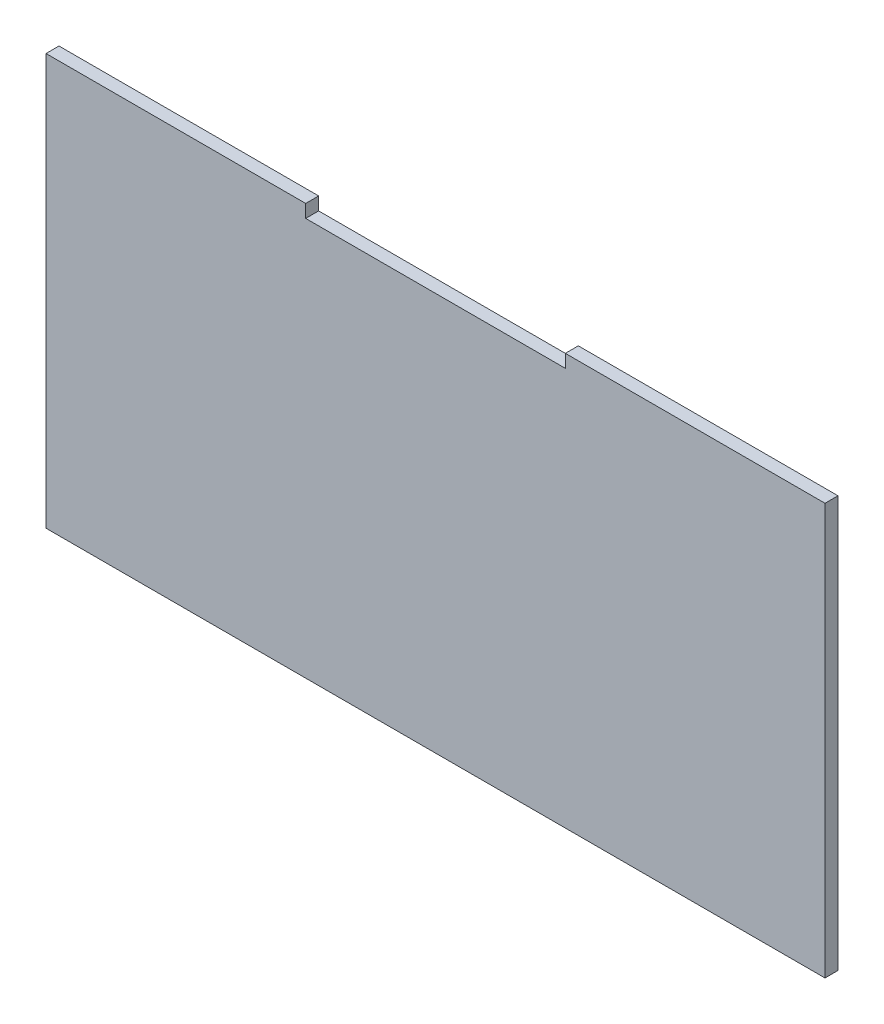
ISO-10303-21;
HEADER;
FILE_DESCRIPTION(('STEP AP214'),'2;1');
FILE_NAME('part.step','',(''),(''),'','','');
FILE_SCHEMA(('AUTOMOTIVE_DESIGN { 1 0 10303 214 1 1 1 1 }'));
ENDSEC;
DATA;
#1=APPLICATION_CONTEXT('core data for automotive mechanical design processes');
#2=APPLICATION_PROTOCOL_DEFINITION('international standard','automotive_design',2000,#1);
#3=PRODUCT_CONTEXT('',#1,'mechanical');
#4=PRODUCT('Part','Part','',(#3));
#5=PRODUCT_RELATED_PRODUCT_CATEGORY('part','',(#4));
#6=PRODUCT_DEFINITION_FORMATION('','',#4);
#7=PRODUCT_DEFINITION_CONTEXT('part definition',#1,'design');
#8=PRODUCT_DEFINITION('design','',#6,#7);
#9=PRODUCT_DEFINITION_SHAPE('','',#8);
#10=(LENGTH_UNIT() NAMED_UNIT(*) SI_UNIT(.MILLI.,.METRE.));
#11=(NAMED_UNIT(*) PLANE_ANGLE_UNIT() SI_UNIT($,.RADIAN.));
#12=(NAMED_UNIT(*) SI_UNIT($,.STERADIAN.) SOLID_ANGLE_UNIT());
#13=UNCERTAINTY_MEASURE_WITH_UNIT(LENGTH_MEASURE(1.E-05),#10,'distance_accuracy_value','');
#14=(GEOMETRIC_REPRESENTATION_CONTEXT(3) GLOBAL_UNCERTAINTY_ASSIGNED_CONTEXT((#13)) GLOBAL_UNIT_ASSIGNED_CONTEXT((#10,
#11,#12)) REPRESENTATION_CONTEXT('',''));
#15=CARTESIAN_POINT('',(0.,0.,0.));
#16=DIRECTION('',(0.,0.,1.));
#17=DIRECTION('',(1.,0.,0.));
#18=AXIS2_PLACEMENT_3D('',#15,#16,#17);
#19=CARTESIAN_POINT('',(-90.,47.5,3.));
#20=DIRECTION('',(1.,0.,0.));
#21=DIRECTION('',(0.,0.,-1.));
#22=AXIS2_PLACEMENT_3D('',#19,#20,#21);
#23=PLANE('',#22);
#24=DIRECTION('',(0.,-1.,0.));
#25=VECTOR('',#24,1.);
#26=CARTESIAN_POINT('',(-90.,47.5,0.));
#27=LINE('',#26,#25);
#28=CARTESIAN_POINT('',(-90.,47.5,0.));
#29=VERTEX_POINT('',#28);
#30=CARTESIAN_POINT('',(-90.,-47.5,0.));
#31=VERTEX_POINT('',#30);
#32=EDGE_CURVE('E130',#29,#31,#27,.T.);
#33=ORIENTED_EDGE('',*,*,#32,.T.);
#34=DIRECTION('',(0.,0.,-1.));
#35=VECTOR('',#34,1.);
#36=CARTESIAN_POINT('',(-90.,-47.5,3.));
#37=LINE('',#36,#35);
#38=CARTESIAN_POINT('',(-90.,-47.5,3.));
#39=VERTEX_POINT('',#38);
#40=EDGE_CURVE('E11',#39,#31,#37,.T.);
#41=ORIENTED_EDGE('',*,*,#40,.F.);
#42=DIRECTION('',(0.,-1.,0.));
#43=VECTOR('',#42,1.);
#44=CARTESIAN_POINT('',(-90.,47.5,3.));
#45=LINE('',#44,#43);
#46=CARTESIAN_POINT('',(-90.,47.5,3.));
#47=VERTEX_POINT('',#46);
#48=EDGE_CURVE('E144',#47,#39,#45,.T.);
#49=ORIENTED_EDGE('',*,*,#48,.F.);
#50=DIRECTION('',(0.,0.,-1.));
#51=VECTOR('',#50,1.);
#52=CARTESIAN_POINT('',(-90.,47.5,3.));
#53=LINE('',#52,#51);
#54=EDGE_CURVE('E126',#47,#29,#53,.T.);
#55=ORIENTED_EDGE('',*,*,#54,.T.);
#56=EDGE_LOOP('',(#33,#41,#49,#55));
#57=FACE_BOUND('',#56,.T.);
#58=ADVANCED_FACE('F34',(#57),#23,.F.);
#59=CARTESIAN_POINT('',(90.,-47.5,3.));
#60=DIRECTION('',(0.,1.,0.));
#61=DIRECTION('',(0.,0.,1.));
#62=AXIS2_PLACEMENT_3D('',#59,#60,#61);
#63=PLANE('',#62);
#64=DIRECTION('',(1.,0.,0.));
#65=VECTOR('',#64,1.);
#66=CARTESIAN_POINT('',(90.,-47.5,0.));
#67=LINE('',#66,#65);
#68=CARTESIAN_POINT('',(90.,-47.5,0.));
#69=VERTEX_POINT('',#68);
#70=EDGE_CURVE('E133',#31,#69,#67,.T.);
#71=ORIENTED_EDGE('',*,*,#70,.T.);
#72=DIRECTION('',(0.,0.,-1.));
#73=VECTOR('',#72,1.);
#74=CARTESIAN_POINT('',(90.,-47.5,3.));
#75=LINE('',#74,#73);
#76=CARTESIAN_POINT('',(90.,-47.5,3.));
#77=VERTEX_POINT('',#76);
#78=EDGE_CURVE('E42',#77,#69,#75,.T.);
#79=ORIENTED_EDGE('',*,*,#78,.F.);
#80=DIRECTION('',(1.,0.,0.));
#81=VECTOR('',#80,1.);
#82=CARTESIAN_POINT('',(90.,-47.5,3.));
#83=LINE('',#82,#81);
#84=EDGE_CURVE('E93',#39,#77,#83,.T.);
#85=ORIENTED_EDGE('',*,*,#84,.F.);
#86=ORIENTED_EDGE('',*,*,#40,.T.);
#87=EDGE_LOOP('',(#71,#79,#85,#86));
#88=FACE_BOUND('',#87,.T.);
#89=ADVANCED_FACE('F179',(#88),#63,.F.);
#90=CARTESIAN_POINT('',(90.,47.5,3.));
#91=DIRECTION('',(-1.,0.,0.));
#92=DIRECTION('',(0.,0.,1.));
#93=AXIS2_PLACEMENT_3D('',#90,#91,#92);
#94=PLANE('',#93);
#95=DIRECTION('',(0.,1.,0.));
#96=VECTOR('',#95,1.);
#97=CARTESIAN_POINT('',(90.,47.5,0.));
#98=LINE('',#97,#96);
#99=CARTESIAN_POINT('',(90.,47.5,0.));
#100=VERTEX_POINT('',#99);
#101=EDGE_CURVE('E135',#69,#100,#98,.T.);
#102=ORIENTED_EDGE('',*,*,#101,.T.);
#103=DIRECTION('',(0.,0.,-1.));
#104=VECTOR('',#103,1.);
#105=CARTESIAN_POINT('',(90.,47.5,3.));
#106=LINE('',#105,#104);
#107=CARTESIAN_POINT('',(90.,47.5,3.));
#108=VERTEX_POINT('',#107);
#109=EDGE_CURVE('E151',#108,#100,#106,.T.);
#110=ORIENTED_EDGE('',*,*,#109,.F.);
#111=DIRECTION('',(0.,1.,0.));
#112=VECTOR('',#111,1.);
#113=CARTESIAN_POINT('',(90.,47.5,3.));
#114=LINE('',#113,#112);
#115=EDGE_CURVE('E159',#77,#108,#114,.T.);
#116=ORIENTED_EDGE('',*,*,#115,.F.);
#117=ORIENTED_EDGE('',*,*,#78,.T.);
#118=EDGE_LOOP('',(#102,#110,#116,#117));
#119=FACE_BOUND('',#118,.T.);
#120=ADVANCED_FACE('F157',(#119),#94,.F.);
#121=CARTESIAN_POINT('',(90.,47.5,3.));
#122=DIRECTION('',(0.,-1.,0.));
#123=DIRECTION('',(0.,0.,-1.));
#124=AXIS2_PLACEMENT_3D('',#121,#122,#123);
#125=PLANE('',#124);
#126=DIRECTION('',(-1.,0.,0.));
#127=VECTOR('',#126,1.);
#128=CARTESIAN_POINT('',(90.,47.5,0.));
#129=LINE('',#128,#127);
#130=CARTESIAN_POINT('',(30.,47.5,0.));
#131=VERTEX_POINT('',#130);
#132=EDGE_CURVE('E137',#100,#131,#129,.T.);
#133=ORIENTED_EDGE('',*,*,#132,.T.);
#134=DIRECTION('',(0.,0.,-1.));
#135=VECTOR('',#134,1.);
#136=CARTESIAN_POINT('',(30.,47.5,3.));
#137=LINE('',#136,#135);
#138=CARTESIAN_POINT('',(30.,47.5,3.));
#139=VERTEX_POINT('',#138);
#140=EDGE_CURVE('E148',#139,#131,#137,.T.);
#141=ORIENTED_EDGE('',*,*,#140,.F.);
#142=DIRECTION('',(-1.,0.,0.));
#143=VECTOR('',#142,1.);
#144=CARTESIAN_POINT('',(90.,47.5,3.));
#145=LINE('',#144,#143);
#146=EDGE_CURVE('E171',#108,#139,#145,.T.);
#147=ORIENTED_EDGE('',*,*,#146,.F.);
#148=ORIENTED_EDGE('',*,*,#109,.T.);
#149=EDGE_LOOP('',(#133,#141,#147,#148));
#150=FACE_BOUND('',#149,.T.);
#151=ADVANCED_FACE('F167',(#150),#125,.F.);
#152=CARTESIAN_POINT('',(30.,47.5,3.));
#153=DIRECTION('',(1.,0.,0.));
#154=DIRECTION('',(0.,0.,-1.));
#155=AXIS2_PLACEMENT_3D('',#152,#153,#154);
#156=PLANE('',#155);
#157=DIRECTION('',(0.,-1.,0.));
#158=VECTOR('',#157,1.);
#159=CARTESIAN_POINT('',(30.,47.5,0.));
#160=LINE('',#159,#158);
#161=CARTESIAN_POINT('',(30.,44.4999999999999,0.));
#162=VERTEX_POINT('',#161);
#163=EDGE_CURVE('E139',#131,#162,#160,.T.);
#164=ORIENTED_EDGE('',*,*,#163,.T.);
#165=DIRECTION('',(0.,0.,-1.));
#166=VECTOR('',#165,1.);
#167=CARTESIAN_POINT('',(30.,44.4999999999999,3.));
#168=LINE('',#167,#166);
#169=CARTESIAN_POINT('',(30.,44.4999999999999,3.));
#170=VERTEX_POINT('',#169);
#171=EDGE_CURVE('E121',#170,#162,#168,.T.);
#172=ORIENTED_EDGE('',*,*,#171,.F.);
#173=DIRECTION('',(0.,-1.,0.));
#174=VECTOR('',#173,1.);
#175=CARTESIAN_POINT('',(30.,47.5,3.));
#176=LINE('',#175,#174);
#177=EDGE_CURVE('E112',#139,#170,#176,.T.);
#178=ORIENTED_EDGE('',*,*,#177,.F.);
#179=ORIENTED_EDGE('',*,*,#140,.T.);
#180=EDGE_LOOP('',(#164,#172,#178,#179));
#181=FACE_BOUND('',#180,.T.);
#182=ADVANCED_FACE('F170',(#181),#156,.F.);
#183=CARTESIAN_POINT('',(-30.,44.4999999999999,3.));
#184=DIRECTION('',(0.,-1.,0.));
#185=DIRECTION('',(0.,0.,-1.));
#186=AXIS2_PLACEMENT_3D('',#183,#184,#185);
#187=PLANE('',#186);
#188=DIRECTION('',(-1.,0.,0.));
#189=VECTOR('',#188,1.);
#190=CARTESIAN_POINT('',(-30.,44.4999999999999,0.));
#191=LINE('',#190,#189);
#192=CARTESIAN_POINT('',(-30.,44.4999999999999,0.));
#193=VERTEX_POINT('',#192);
#194=EDGE_CURVE('E120',#162,#193,#191,.T.);
#195=ORIENTED_EDGE('',*,*,#194,.T.);
#196=DIRECTION('',(0.,0.,-1.));
#197=VECTOR('',#196,1.);
#198=CARTESIAN_POINT('',(-30.,44.4999999999999,3.));
#199=LINE('',#198,#197);
#200=CARTESIAN_POINT('',(-30.,44.4999999999999,3.));
#201=VERTEX_POINT('',#200);
#202=EDGE_CURVE('E117',#201,#193,#199,.T.);
#203=ORIENTED_EDGE('',*,*,#202,.F.);
#204=DIRECTION('',(-1.,0.,0.));
#205=VECTOR('',#204,1.);
#206=CARTESIAN_POINT('',(-30.,44.4999999999999,3.));
#207=LINE('',#206,#205);
#208=EDGE_CURVE('E106',#170,#201,#207,.T.);
#209=ORIENTED_EDGE('',*,*,#208,.F.);
#210=ORIENTED_EDGE('',*,*,#171,.T.);
#211=EDGE_LOOP('',(#195,#203,#209,#210));
#212=FACE_BOUND('',#211,.T.);
#213=ADVANCED_FACE('F118',(#212),#187,.F.);
#214=CARTESIAN_POINT('',(-30.,47.5,3.));
#215=DIRECTION('',(-1.,0.,0.));
#216=DIRECTION('',(0.,-1.,0.));
#217=AXIS2_PLACEMENT_3D('',#214,#215,#216);
#218=PLANE('',#217);
#219=DIRECTION('',(0.,1.,0.));
#220=VECTOR('',#219,1.);
#221=CARTESIAN_POINT('',(-30.,47.5,0.));
#222=LINE('',#221,#220);
#223=CARTESIAN_POINT('',(-30.,47.5,0.));
#224=VERTEX_POINT('',#223);
#225=EDGE_CURVE('E79',#193,#224,#222,.T.);
#226=ORIENTED_EDGE('',*,*,#225,.T.);
#227=DIRECTION('',(0.,0.,-1.));
#228=VECTOR('',#227,1.);
#229=CARTESIAN_POINT('',(-30.,47.5,3.));
#230=LINE('',#229,#228);
#231=CARTESIAN_POINT('',(-30.,47.5,3.));
#232=VERTEX_POINT('',#231);
#233=EDGE_CURVE('E122',#232,#224,#230,.T.);
#234=ORIENTED_EDGE('',*,*,#233,.F.);
#235=DIRECTION('',(0.,1.,0.));
#236=VECTOR('',#235,1.);
#237=CARTESIAN_POINT('',(-30.,47.5,3.));
#238=LINE('',#237,#236);
#239=EDGE_CURVE('E110',#201,#232,#238,.T.);
#240=ORIENTED_EDGE('',*,*,#239,.F.);
#241=ORIENTED_EDGE('',*,*,#202,.T.);
#242=EDGE_LOOP('',(#226,#234,#240,#241));
#243=FACE_BOUND('',#242,.T.);
#244=ADVANCED_FACE('F124',(#243),#218,.F.);
#245=CARTESIAN_POINT('',(-30.,47.5,3.));
#246=DIRECTION('',(0.,-1.,0.));
#247=DIRECTION('',(0.,0.,-1.));
#248=AXIS2_PLACEMENT_3D('',#245,#246,#247);
#249=PLANE('',#248);
#250=DIRECTION('',(-1.,0.,0.));
#251=VECTOR('',#250,1.);
#252=CARTESIAN_POINT('',(-30.,47.5,0.));
#253=LINE('',#252,#251);
#254=EDGE_CURVE('E85',#224,#29,#253,.T.);
#255=ORIENTED_EDGE('',*,*,#254,.T.);
#256=ORIENTED_EDGE('',*,*,#54,.F.);
#257=DIRECTION('',(-1.,0.,0.));
#258=VECTOR('',#257,1.);
#259=CARTESIAN_POINT('',(-30.,47.5,3.));
#260=LINE('',#259,#258);
#261=EDGE_CURVE('E50',#232,#47,#260,.T.);
#262=ORIENTED_EDGE('',*,*,#261,.F.);
#263=ORIENTED_EDGE('',*,*,#233,.T.);
#264=EDGE_LOOP('',(#255,#256,#262,#263));
#265=FACE_BOUND('',#264,.T.);
#266=ADVANCED_FACE('F195',(#265),#249,.F.);
#267=CARTESIAN_POINT('',(0.,0.,3.));
#268=DIRECTION('',(0.,0.,-1.));
#269=DIRECTION('',(-1.,0.,0.));
#270=AXIS2_PLACEMENT_3D('',#267,#268,#269);
#271=PLANE('',#270);
#272=ORIENTED_EDGE('',*,*,#48,.T.);
#273=ORIENTED_EDGE('',*,*,#84,.T.);
#274=ORIENTED_EDGE('',*,*,#115,.T.);
#275=ORIENTED_EDGE('',*,*,#146,.T.);
#276=ORIENTED_EDGE('',*,*,#177,.T.);
#277=ORIENTED_EDGE('',*,*,#208,.T.);
#278=ORIENTED_EDGE('',*,*,#239,.T.);
#279=ORIENTED_EDGE('',*,*,#261,.T.);
#280=EDGE_LOOP('',(#272,#273,#274,#275,#276,#277,#278,#279));
#281=FACE_BOUND('',#280,.T.);
#282=ADVANCED_FACE('F108',(#281),#271,.F.);
#283=CARTESIAN_POINT('',(0.,0.,0.));
#284=DIRECTION('',(0.,0.,-1.));
#285=DIRECTION('',(-1.,0.,0.));
#286=AXIS2_PLACEMENT_3D('',#283,#284,#285);
#287=PLANE('',#286);
#288=ORIENTED_EDGE('',*,*,#32,.F.);
#289=ORIENTED_EDGE('',*,*,#254,.F.);
#290=ORIENTED_EDGE('',*,*,#225,.F.);
#291=ORIENTED_EDGE('',*,*,#194,.F.);
#292=ORIENTED_EDGE('',*,*,#163,.F.);
#293=ORIENTED_EDGE('',*,*,#132,.F.);
#294=ORIENTED_EDGE('',*,*,#101,.F.);
#295=ORIENTED_EDGE('',*,*,#70,.F.);
#296=EDGE_LOOP('',(#288,#289,#290,#291,#292,#293,#294,#295));
#297=FACE_BOUND('',#296,.T.);
#298=ADVANCED_FACE('F163',(#297),#287,.T.);
#299=CLOSED_SHELL('',(#58,#89,#120,#151,#182,#213,#244,#266,#282,#298));
#300=MANIFOLD_SOLID_BREP('B2',#299);
#301=ADVANCED_BREP_SHAPE_REPRESENTATION('',(#18,#300),#14);
#302=SHAPE_DEFINITION_REPRESENTATION(#9,#301);
ENDSEC;
END-ISO-10303-21;
